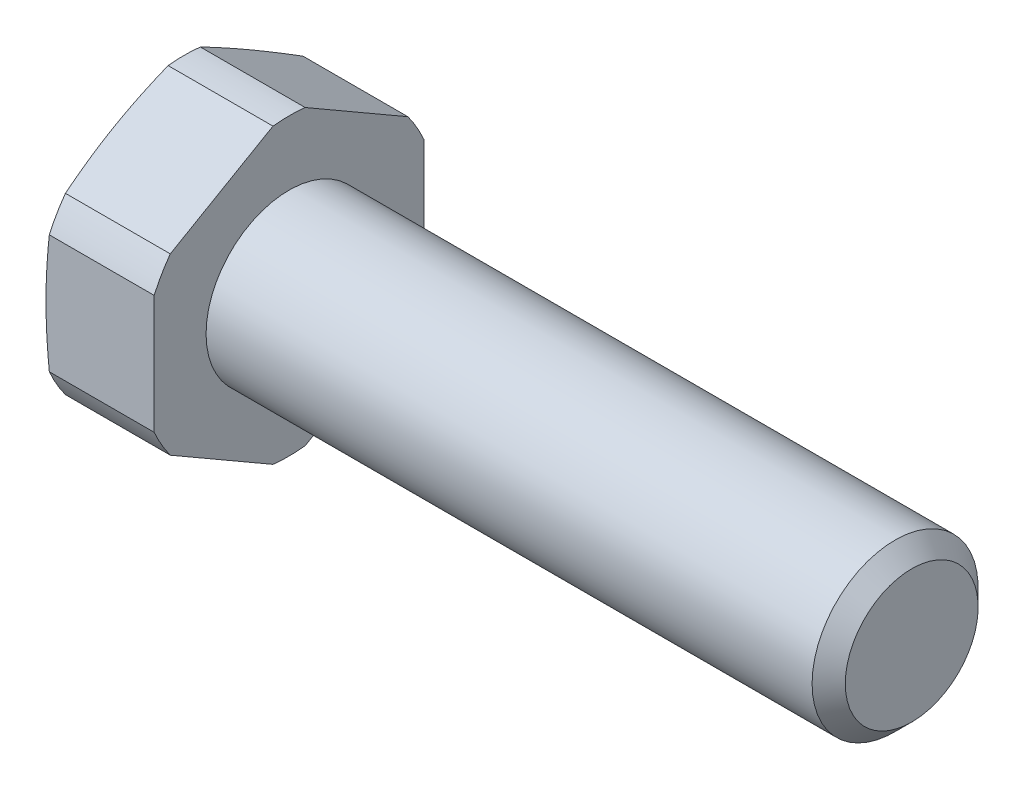
ISO-10303-21;
HEADER;
FILE_DESCRIPTION(('STEP AP214'),'2;1');
FILE_NAME('part.step','',(''),(''),'','','');
FILE_SCHEMA(('AUTOMOTIVE_DESIGN { 1 0 10303 214 1 1 1 1 }'));
ENDSEC;
DATA;
#1=APPLICATION_CONTEXT('core data for automotive mechanical design processes');
#2=APPLICATION_PROTOCOL_DEFINITION('international standard','automotive_design',2000,#1);
#3=PRODUCT_CONTEXT('',#1,'mechanical');
#4=PRODUCT('Part','Part','',(#3));
#5=PRODUCT_RELATED_PRODUCT_CATEGORY('part','',(#4));
#6=PRODUCT_DEFINITION_FORMATION('','',#4);
#7=PRODUCT_DEFINITION_CONTEXT('part definition',#1,'design');
#8=PRODUCT_DEFINITION('design','',#6,#7);
#9=PRODUCT_DEFINITION_SHAPE('','',#8);
#10=(LENGTH_UNIT() NAMED_UNIT(*) SI_UNIT(.MILLI.,.METRE.));
#11=(NAMED_UNIT(*) PLANE_ANGLE_UNIT() SI_UNIT($,.RADIAN.));
#12=(NAMED_UNIT(*) SI_UNIT($,.STERADIAN.) SOLID_ANGLE_UNIT());
#13=UNCERTAINTY_MEASURE_WITH_UNIT(LENGTH_MEASURE(1.E-05),#10,'distance_accuracy_value','');
#14=(GEOMETRIC_REPRESENTATION_CONTEXT(3) GLOBAL_UNCERTAINTY_ASSIGNED_CONTEXT((#13)) GLOBAL_UNIT_ASSIGNED_CONTEXT((#10,
#11,#12)) REPRESENTATION_CONTEXT('',''));
#15=CARTESIAN_POINT('',(0.,0.,0.));
#16=DIRECTION('',(0.,0.,1.));
#17=DIRECTION('',(1.,0.,0.));
#18=AXIS2_PLACEMENT_3D('',#15,#16,#17);
#19=CARTESIAN_POINT('',(-5.05214699700118,0.,0.));
#20=DIRECTION('',(1.,0.,0.));
#21=DIRECTION('',(0.,0.,-1.));
#22=AXIS2_PLACEMENT_3D('',#19,#20,#21);
#23=CONICAL_SURFACE('',#22,7.1,1.30899693899575);
#24=CARTESIAN_POINT('',(-5.29999999999997,0.,0.));
#25=DIRECTION('',(-1.,0.,0.));
#26=DIRECTION('',(0.,0.,1.));
#27=AXIS2_PLACEMENT_3D('',#24,#25,#26);
#28=CIRCLE('',#27,6.175);
#29=CARTESIAN_POINT('',(-5.29999999999997,0.,6.175));
#30=VERTEX_POINT('',#29);
#31=EDGE_CURVE('E139',#30,#30,#28,.T.);
#32=ORIENTED_EDGE('',*,*,#31,.F.);
#33=EDGE_LOOP('',(#32));
#34=FACE_BOUND('',#33,.T.);
#35=CARTESIAN_POINT('',(-5.05194699700118,4.19995209101869,-5.72546958900048));
#36=CARTESIAN_POINT('',(-5.07760027496928,4.31878271807594,-5.51964890544205));
#37=CARTESIAN_POINT('',(-5.10057398869207,4.43776618363352,-5.3135634978357));
#38=CARTESIAN_POINT('',(-5.14056478113438,4.67600028246682,-4.90092993456105));
#39=CARTESIAN_POINT('',(-5.1575809443837,4.79525095397189,-4.69438171267755));
#40=CARTESIAN_POINT('',(-5.18500732267828,5.0335659386847,-4.28160805094997));
#41=CARTESIAN_POINT('',(-5.19543831566365,5.15262964360177,-4.07538366469622));
#42=CARTESIAN_POINT('',(-5.20939266077495,5.39085061213871,-3.66277284376197));
#43=CARTESIAN_POINT('',(-5.21291651245986,5.51000786836884,-3.45638642188087));
#44=CARTESIAN_POINT('',(-5.21291651245985,5.74832238082912,-3.04361357811868));
#45=CARTESIAN_POINT('',(-5.20939266077494,5.86747963705925,-2.83722715623758));
#46=CARTESIAN_POINT('',(-5.19543831566363,6.10570060559619,-2.42461633530333));
#47=CARTESIAN_POINT('',(-5.18500732267826,6.22476431051326,-2.21839194904958));
#48=CARTESIAN_POINT('',(-5.15758094438367,6.46307929522607,-1.805618287322));
#49=CARTESIAN_POINT('',(-5.14056478113434,6.58232996673114,-1.5990700654385));
#50=CARTESIAN_POINT('',(-5.10057398869203,6.82056406556443,-1.18643650216385));
#51=CARTESIAN_POINT('',(-5.07760027496923,6.93954753112201,-0.980351094557502));
#52=CARTESIAN_POINT('',(-5.05194699700113,7.05837815817927,-0.774530410999076));
#53=B_SPLINE_CURVE_WITH_KNOTS('',3,(#35,#36,#37,#38,#39,#40,#41,#42,#43,#44,#45,#46,#47,#48,#49,
#50,#51,#52),.UNSPECIFIED.,.F.,.F.,(4,2,2,2,2,2,2,2,4),(0.,0.717134619479339,1.43437938951781,
2.14934960199472,2.86426810234588,3.57918660269703,4.29415681517394,5.01140158521241,
5.72853620469175),.UNSPECIFIED.);
#54=CARTESIAN_POINT('',(-5.05214699700118,4.20087943889028,-5.72386337537059));
#55=VERTEX_POINT('',#54);
#56=CARTESIAN_POINT('',(-5.05214699700118,7.05745081030742,-0.776136624629402));
#57=VERTEX_POINT('',#56);
#58=EDGE_CURVE('E211',#55,#57,#53,.T.);
#59=ORIENTED_EDGE('',*,*,#58,.F.);
#60=CARTESIAN_POINT('',(-5.05214699700118,0.,0.));
#61=DIRECTION('',(-1.,0.,0.));
#62=DIRECTION('',(0.,0.,1.));
#63=AXIS2_PLACEMENT_3D('',#60,#61,#62);
#64=CIRCLE('',#63,7.1);
#65=CARTESIAN_POINT('',(-5.05214699700118,2.85657137141714,-6.5));
#66=VERTEX_POINT('',#65);
#67=EDGE_CURVE('E294',#55,#66,#64,.T.);
#68=ORIENTED_EDGE('',*,*,#67,.T.);
#69=CARTESIAN_POINT('',(-3.77950089472168,-9.90770125370273,-6.5));
#70=CARTESIAN_POINT('',(-3.84549923221771,-9.61303683004902,-6.5));
#71=CARTESIAN_POINT('',(-3.91068708305299,-9.31818755285982,-6.5));
#72=CARTESIAN_POINT('',(-4.03900435606356,-8.72802854950381,-6.5));
#73=CARTESIAN_POINT('',(-4.10213368872072,-8.43271880389633,-6.5));
#74=CARTESIAN_POINT('',(-4.22595195035626,-7.84128094408398,-6.5));
#75=CARTESIAN_POINT('',(-4.28663840023621,-7.5451523090157,-6.5));
#76=CARTESIAN_POINT('',(-4.4049126937163,-6.95227722725182,-6.5));
#77=CARTESIAN_POINT('',(-4.46250056367929,-6.65553078583486,-6.5));
#78=CARTESIAN_POINT('',(-4.57339453337853,-6.06368986807948,-6.5));
#79=CARTESIAN_POINT('',(-4.62673117435109,-5.76860114266199,-6.5));
#80=CARTESIAN_POINT('',(-4.72872616796672,-5.17761769171761,-6.5));
#81=CARTESIAN_POINT('',(-4.77738462407619,-4.88172298416536,-6.5));
#82=CARTESIAN_POINT('',(-4.86892350982985,-4.28907239039307,-6.5));
#83=CARTESIAN_POINT('',(-4.91180468331148,-3.99231662007226,-6.5));
#84=CARTESIAN_POINT('',(-4.99052177949499,-3.39786141661488,-6.5));
#85=CARTESIAN_POINT('',(-5.02635769642816,-3.10016198270582,-6.5));
#86=CARTESIAN_POINT('',(-5.08996536212492,-2.5004683432848,-6.5));
#87=CARTESIAN_POINT('',(-5.1176408530834,-2.19846377390436,-6.5));
#88=CARTESIAN_POINT('',(-5.16301575116526,-1.59369968950732,-6.5));
#89=CARTESIAN_POINT('',(-5.18071538706159,-1.29094019196316,-6.5));
#90=CARTESIAN_POINT('',(-5.20510605570838,-0.685105061534515,-6.5));
#91=CARTESIAN_POINT('',(-5.21180202439831,-0.382029631451969,-6.5));
#92=CARTESIAN_POINT('',(-5.21377415859077,0.224158974521351,-6.5));
#93=CARTESIAN_POINT('',(-5.20905033033111,0.527272150391417,-6.5));
#94=CARTESIAN_POINT('',(-5.18844845784126,1.13421773965102,-6.5));
#95=CARTESIAN_POINT('',(-5.17252981467392,1.43804874687802,-6.5));
#96=CARTESIAN_POINT('',(-5.13044490350295,2.04499361527491,-6.5));
#97=CARTESIAN_POINT('',(-5.10427841006816,2.34810746052116,-6.5));
#98=CARTESIAN_POINT('',(-5.04301462259277,2.95361619476168,-6.5));
#99=CARTESIAN_POINT('',(-5.00791153851841,3.25601048886053,-6.5));
#100=CARTESIAN_POINT('',(-4.93022920552248,3.8598266281922,-6.5));
#101=CARTESIAN_POINT('',(-4.88764993371114,4.16124847044479,-6.5));
#102=CARTESIAN_POINT('',(-4.79942061262059,4.74304526391516,-6.5));
#103=CARTESIAN_POINT('',(-4.7541658547133,5.02348076975636,-6.5));
#104=CARTESIAN_POINT('',(-4.65928179773904,5.58361433540142,-6.5));
#105=CARTESIAN_POINT('',(-4.60965238023525,5.86331237502831,-6.5));
#106=CARTESIAN_POINT('',(-4.50681836335408,6.42207301698527,-6.5));
#107=CARTESIAN_POINT('',(-4.45361344604534,6.70113556052032,-6.5));
#108=CARTESIAN_POINT('',(-4.34428024606978,7.2586887797512,-6.5));
#109=CARTESIAN_POINT('',(-4.28815192576296,7.5371794480359,-6.5));
#110=CARTESIAN_POINT('',(-4.11617513273683,8.37203815656081,-6.5));
#111=CARTESIAN_POINT('',(-3.99675790685842,8.92767029566482,-6.5));
#112=CARTESIAN_POINT('',(-3.75146990372668,10.037459547231,-6.5));
#113=CARTESIAN_POINT('',(-3.62559950106499,10.5916167433503,-6.5));
#114=CARTESIAN_POINT('',(-3.37057620947702,11.693405700181,-6.5));
#115=CARTESIAN_POINT('',(-3.24146803677519,12.2410478396252,-6.5));
#116=CARTESIAN_POINT('',(-2.98002169310474,13.3355686749825,-6.5));
#117=CARTESIAN_POINT('',(-2.84768346371383,13.8824473568975,-6.5));
#118=CARTESIAN_POINT('',(-2.58078319258935,14.9749505577544,-6.5));
#119=CARTESIAN_POINT('',(-2.44622407444428,15.5205757923582,-6.5));
#120=CARTESIAN_POINT('',(-2.1752684767797,16.611351157403,-6.5));
#121=CARTESIAN_POINT('',(-2.03887205773507,17.1565013028558,-6.5));
#122=CARTESIAN_POINT('',(-1.90182465532039,17.7014857538417,-6.5));
#123=B_SPLINE_CURVE_WITH_KNOTS('',3,(#69,#70,#71,#72,#73,#74,#75,#76,#77,#78,#79,#80,#81,#82,
#83,#84,#85,#86,#87,#88,#89,#90,#91,#92,#93,#94,#95,#96,#97,#98,#99,#100,#101,#102,#103,#104,
#105,#106,#107,#108,#109,#110,#111,#112,#113,#114,#115,#116,#117,#118,#119,#120,#121,#122),
.UNSPECIFIED.,.F.,.F.,(4,2,2,2,2,2,2,2,2,2,2,2,2,2,2,2,2,2,2,2,2,2,2,2,2,2,4),(0.,
0.905898920692892,1.81183718353167,2.71867275809954,3.62550061605085,4.52508121778624,
5.42464191911476,6.32408668917737,7.22353219570963,8.13319785926568,9.04284266091374,
9.95207930967697,10.8613154617895,11.7738661542407,12.6864369220163,13.5996004575465,
14.5127667889475,15.3649164610577,16.2170892108291,17.0693378358233,17.9215974365787,
19.6264908547873,21.3312854197707,23.0192370587519,24.7072192505044,26.3931331153493,
28.0789916231747),.UNSPECIFIED.);
#124=CARTESIAN_POINT('',(-5.05214699700118,-2.85657137141714,-6.5));
#125=VERTEX_POINT('',#124);
#126=EDGE_CURVE('E190',#125,#66,#123,.T.);
#127=ORIENTED_EDGE('',*,*,#126,.F.);
#128=CARTESIAN_POINT('',(-5.05214699700118,-4.20087943889029,-5.72386337537059));
#129=VERTEX_POINT('',#128);
#130=EDGE_CURVE('E189',#125,#129,#64,.T.);
#131=ORIENTED_EDGE('',*,*,#130,.T.);
#132=CARTESIAN_POINT('',(-5.05194699700113,-7.05837815817927,-0.774530410999076));
#133=CARTESIAN_POINT('',(-5.07760027496923,-6.93954753112201,-0.980351094557502));
#134=CARTESIAN_POINT('',(-5.10057398869203,-6.82056406556443,-1.18643650216385));
#135=CARTESIAN_POINT('',(-5.14056478113434,-6.58232996673114,-1.5990700654385));
#136=CARTESIAN_POINT('',(-5.15758094438367,-6.46307929522607,-1.805618287322));
#137=CARTESIAN_POINT('',(-5.18500732267826,-6.22476431051326,-2.21839194904958));
#138=CARTESIAN_POINT('',(-5.19543831566363,-6.10570060559619,-2.42461633530333));
#139=CARTESIAN_POINT('',(-5.20939266077494,-5.86747963705925,-2.83722715623758));
#140=CARTESIAN_POINT('',(-5.21291651245985,-5.74832238082912,-3.04361357811868));
#141=CARTESIAN_POINT('',(-5.21291651245986,-5.51000786836884,-3.45638642188087));
#142=CARTESIAN_POINT('',(-5.20939266077495,-5.39085061213871,-3.66277284376197));
#143=CARTESIAN_POINT('',(-5.19543831566365,-5.15262964360177,-4.07538366469622));
#144=CARTESIAN_POINT('',(-5.18500732267828,-5.0335659386847,-4.28160805094997));
#145=CARTESIAN_POINT('',(-5.1575809443837,-4.79525095397189,-4.69438171267755));
#146=CARTESIAN_POINT('',(-5.14056478113438,-4.67600028246682,-4.90092993456105));
#147=CARTESIAN_POINT('',(-5.10057398869207,-4.43776618363352,-5.3135634978357));
#148=CARTESIAN_POINT('',(-5.07760027496928,-4.31878271807594,-5.51964890544205));
#149=CARTESIAN_POINT('',(-5.05194699700118,-4.19995209101869,-5.72546958900048));
#150=B_SPLINE_CURVE_WITH_KNOTS('',3,(#132,#133,#134,#135,#136,#137,#138,#139,#140,#141,#142,
#143,#144,#145,#146,#147,#148,#149),.UNSPECIFIED.,.F.,.F.,(4,2,2,2,2,2,2,2,4),(0.,
0.717134619479339,1.43437938951781,2.14934960199472,2.86426810234588,3.57918660269703,
4.29415681517395,5.01140158521242,5.72853620469176),.UNSPECIFIED.);
#151=CARTESIAN_POINT('',(-5.05214699700118,-7.05745081030742,-0.776136624629407));
#152=VERTEX_POINT('',#151);
#153=EDGE_CURVE('E276',#152,#129,#150,.T.);
#154=ORIENTED_EDGE('',*,*,#153,.F.);
#155=CARTESIAN_POINT('',(-5.05214699700118,-7.05745081030742,0.776136624629402));
#156=VERTEX_POINT('',#155);
#157=EDGE_CURVE('E296',#152,#156,#64,.T.);
#158=ORIENTED_EDGE('',*,*,#157,.T.);
#159=CARTESIAN_POINT('',(-5.05194699700118,-4.19995209101869,5.72546958900048));
#160=CARTESIAN_POINT('',(-5.07760027496928,-4.31878271807594,5.51964890544205));
#161=CARTESIAN_POINT('',(-5.10057398869207,-4.43776618363352,5.3135634978357));
#162=CARTESIAN_POINT('',(-5.14056478113438,-4.67600028246681,4.90092993456106));
#163=CARTESIAN_POINT('',(-5.1575809443837,-4.79525095397189,4.69438171267755));
#164=CARTESIAN_POINT('',(-5.18500732267828,-5.0335659386847,4.28160805094997));
#165=CARTESIAN_POINT('',(-5.19543831566365,-5.15262964360177,4.07538366469622));
#166=CARTESIAN_POINT('',(-5.20939266077495,-5.39085061213871,3.66277284376197));
#167=CARTESIAN_POINT('',(-5.21291651245986,-5.51000786836884,3.45638642188088));
#168=CARTESIAN_POINT('',(-5.21291651245985,-5.74832238082911,3.04361357811868));
#169=CARTESIAN_POINT('',(-5.20939266077494,-5.86747963705925,2.83722715623758));
#170=CARTESIAN_POINT('',(-5.19543831566363,-6.10570060559619,2.42461633530333));
#171=CARTESIAN_POINT('',(-5.18500732267826,-6.22476431051326,2.21839194904958));
#172=CARTESIAN_POINT('',(-5.15758094438367,-6.46307929522606,1.805618287322));
#173=CARTESIAN_POINT('',(-5.14056478113434,-6.58232996673114,1.5990700654385));
#174=CARTESIAN_POINT('',(-5.10057398869203,-6.82056406556443,1.18643650216385));
#175=CARTESIAN_POINT('',(-5.07760027496923,-6.93954753112201,0.980351094557502));
#176=CARTESIAN_POINT('',(-5.05194699700113,-7.05837815817926,0.774530410999075));
#177=B_SPLINE_CURVE_WITH_KNOTS('',3,(#159,#160,#161,#162,#163,#164,#165,#166,#167,#168,#169,
#170,#171,#172,#173,#174,#175,#176),.UNSPECIFIED.,.F.,.F.,(4,2,2,2,2,2,2,2,4),(0.,
0.717134619479339,1.43437938951781,2.14934960199472,2.86426810234588,3.57918660269703,
4.29415681517395,5.01140158521242,5.72853620469176),.UNSPECIFIED.);
#178=CARTESIAN_POINT('',(-5.05214699700118,-4.20087943889028,5.72386337537059));
#179=VERTEX_POINT('',#178);
#180=EDGE_CURVE('E265',#179,#156,#177,.T.);
#181=ORIENTED_EDGE('',*,*,#180,.F.);
#182=CARTESIAN_POINT('',(-5.05214699700118,-2.85657137141715,6.5));
#183=VERTEX_POINT('',#182);
#184=EDGE_CURVE('E157',#179,#183,#64,.T.);
#185=ORIENTED_EDGE('',*,*,#184,.T.);
#186=CARTESIAN_POINT('',(-3.77950089472168,-9.90770125370273,6.5));
#187=CARTESIAN_POINT('',(-3.84549923221771,-9.61303683004902,6.5));
#188=CARTESIAN_POINT('',(-3.910687083053,-9.31818755285982,6.5));
#189=CARTESIAN_POINT('',(-4.03900435606356,-8.72802854950381,6.5));
#190=CARTESIAN_POINT('',(-4.10213368872072,-8.43271880389633,6.5));
#191=CARTESIAN_POINT('',(-4.22595195035626,-7.84128094408397,6.5));
#192=CARTESIAN_POINT('',(-4.28663840023621,-7.5451523090157,6.5));
#193=CARTESIAN_POINT('',(-4.4049126937163,-6.95227722725182,6.5));
#194=CARTESIAN_POINT('',(-4.46250056367929,-6.65553078583486,6.5));
#195=CARTESIAN_POINT('',(-4.57339453337853,-6.06368986807948,6.5));
#196=CARTESIAN_POINT('',(-4.62673117435109,-5.76860114266198,6.5));
#197=CARTESIAN_POINT('',(-4.72872616796673,-5.1776176917176,6.5));
#198=CARTESIAN_POINT('',(-4.7773846240762,-4.88172298416536,6.5));
#199=CARTESIAN_POINT('',(-4.86892350982985,-4.28907239039307,6.5));
#200=CARTESIAN_POINT('',(-4.91180468331148,-3.99231662007226,6.5));
#201=CARTESIAN_POINT('',(-4.99052177949499,-3.39786141661488,6.5));
#202=CARTESIAN_POINT('',(-5.02635769642816,-3.10016198270582,6.5));
#203=CARTESIAN_POINT('',(-5.08996536212492,-2.5004683432848,6.5));
#204=CARTESIAN_POINT('',(-5.1176408530834,-2.19846377390436,6.5));
#205=CARTESIAN_POINT('',(-5.16301575116526,-1.59369968950732,6.5));
#206=CARTESIAN_POINT('',(-5.18071538706159,-1.29094019196316,6.5));
#207=CARTESIAN_POINT('',(-5.20510605570838,-0.685105061534518,6.5));
#208=CARTESIAN_POINT('',(-5.21180202439831,-0.382029631451971,6.5));
#209=CARTESIAN_POINT('',(-5.21377415859077,0.224158974521348,6.5));
#210=CARTESIAN_POINT('',(-5.20905033033111,0.527272150391414,6.5));
#211=CARTESIAN_POINT('',(-5.18844845784126,1.13421773965101,6.5));
#212=CARTESIAN_POINT('',(-5.17252981467392,1.43804874687802,6.5));
#213=CARTESIAN_POINT('',(-5.13044490350295,2.04499361527491,6.5));
#214=CARTESIAN_POINT('',(-5.10427841006816,2.34810746052116,6.5));
#215=CARTESIAN_POINT('',(-5.04301462259277,2.95361619476167,6.5));
#216=CARTESIAN_POINT('',(-5.00791153851841,3.25601048886052,6.5));
#217=CARTESIAN_POINT('',(-4.93022920552248,3.85982662819219,6.5));
#218=CARTESIAN_POINT('',(-4.88764993371114,4.16124847044479,6.5));
#219=CARTESIAN_POINT('',(-4.79942061262059,4.74304526391516,6.5));
#220=CARTESIAN_POINT('',(-4.7541658547133,5.02348076975635,6.5));
#221=CARTESIAN_POINT('',(-4.65928179773904,5.58361433540142,6.5));
#222=CARTESIAN_POINT('',(-4.60965238023525,5.86331237502831,6.5));
#223=CARTESIAN_POINT('',(-4.50681836335408,6.42207301698527,6.5));
#224=CARTESIAN_POINT('',(-4.45361344604534,6.70113556052032,6.5));
#225=CARTESIAN_POINT('',(-4.34428024606978,7.2586887797512,6.5));
#226=CARTESIAN_POINT('',(-4.28815192576296,7.53717944803591,6.5));
#227=CARTESIAN_POINT('',(-4.11617513273683,8.37203815656081,6.5));
#228=CARTESIAN_POINT('',(-3.99675790685842,8.92767029566482,6.5));
#229=CARTESIAN_POINT('',(-3.75146990372668,10.037459547231,6.5));
#230=CARTESIAN_POINT('',(-3.62559950106499,10.5916167433503,6.5));
#231=CARTESIAN_POINT('',(-3.37057620947702,11.693405700181,6.5));
#232=CARTESIAN_POINT('',(-3.24146803677519,12.2410478396252,6.5));
#233=CARTESIAN_POINT('',(-2.98002169310474,13.3355686749825,6.5));
#234=CARTESIAN_POINT('',(-2.84768346371383,13.8824473568975,6.5));
#235=CARTESIAN_POINT('',(-2.58078319258935,14.9749505577544,6.5));
#236=CARTESIAN_POINT('',(-2.44622407444428,15.5205757923582,6.5));
#237=CARTESIAN_POINT('',(-2.1752684767797,16.611351157403,6.5));
#238=CARTESIAN_POINT('',(-2.03887205773507,17.1565013028558,6.5));
#239=CARTESIAN_POINT('',(-1.90182465532039,17.7014857538417,6.5));
#240=B_SPLINE_CURVE_WITH_KNOTS('',3,(#186,#187,#188,#189,#190,#191,#192,#193,#194,#195,#196,
#197,#198,#199,#200,#201,#202,#203,#204,#205,#206,#207,#208,#209,#210,#211,#212,#213,#214,#215,
#216,#217,#218,#219,#220,#221,#222,#223,#224,#225,#226,#227,#228,#229,#230,#231,#232,#233,#234,
#235,#236,#237,#238,#239),.UNSPECIFIED.,.F.,.F.,(4,2,2,2,2,2,2,2,2,2,2,2,2,2,2,2,2,2,2,2,2,2,2,
2,2,2,4),(0.,0.905898920692892,1.81183718353167,2.71867275809954,3.62550061605085,
4.52508121778624,5.42464191911476,6.32408668917737,7.22353219570962,8.13319785926568,
9.04284266091373,9.95207930967697,10.8613154617895,11.7738661542407,12.6864369220163,
13.5996004575465,14.5127667889475,15.3649164610577,16.217089210829,17.0693378358233,
17.9215974365787,19.6264908547873,21.3312854197707,23.0192370587519,24.7072192505044,
26.3931331153493,28.0789916231747),.UNSPECIFIED.);
#241=CARTESIAN_POINT('',(-5.05214699700118,2.85657137141715,6.5));
#242=VERTEX_POINT('',#241);
#243=EDGE_CURVE('E248',#242,#183,#240,.F.);
#244=ORIENTED_EDGE('',*,*,#243,.F.);
#245=CARTESIAN_POINT('',(-5.05214699700118,4.20087943889028,5.72386337537059));
#246=VERTEX_POINT('',#245);
#247=EDGE_CURVE('E165',#242,#246,#64,.T.);
#248=ORIENTED_EDGE('',*,*,#247,.T.);
#249=CARTESIAN_POINT('',(-5.05194699700113,7.05837815817927,0.774530410999076));
#250=CARTESIAN_POINT('',(-5.07760027496923,6.93954753112201,0.980351094557502));
#251=CARTESIAN_POINT('',(-5.10057398869203,6.82056406556443,1.18643650216385));
#252=CARTESIAN_POINT('',(-5.14056478113434,6.58232996673114,1.5990700654385));
#253=CARTESIAN_POINT('',(-5.15758094438367,6.46307929522607,1.805618287322));
#254=CARTESIAN_POINT('',(-5.18500732267826,6.22476431051326,2.21839194904958));
#255=CARTESIAN_POINT('',(-5.19543831566363,6.10570060559619,2.42461633530333));
#256=CARTESIAN_POINT('',(-5.20939266077494,5.86747963705925,2.83722715623758));
#257=CARTESIAN_POINT('',(-5.21291651245985,5.74832238082911,3.04361357811868));
#258=CARTESIAN_POINT('',(-5.21291651245986,5.51000786836884,3.45638642188087));
#259=CARTESIAN_POINT('',(-5.20939266077495,5.39085061213871,3.66277284376197));
#260=CARTESIAN_POINT('',(-5.19543831566365,5.15262964360177,4.07538366469622));
#261=CARTESIAN_POINT('',(-5.18500732267828,5.0335659386847,4.28160805094997));
#262=CARTESIAN_POINT('',(-5.1575809443837,4.79525095397189,4.69438171267755));
#263=CARTESIAN_POINT('',(-5.14056478113438,4.67600028246682,4.90092993456105));
#264=CARTESIAN_POINT('',(-5.10057398869207,4.43776618363352,5.3135634978357));
#265=CARTESIAN_POINT('',(-5.07760027496928,4.31878271807594,5.51964890544205));
#266=CARTESIAN_POINT('',(-5.05194699700118,4.19995209101869,5.72546958900048));
#267=B_SPLINE_CURVE_WITH_KNOTS('',3,(#249,#250,#251,#252,#253,#254,#255,#256,#257,#258,#259,
#260,#261,#262,#263,#264,#265,#266),.UNSPECIFIED.,.F.,.F.,(4,2,2,2,2,2,2,2,4),(0.,
0.71713461947934,1.43437938951781,2.14934960199472,2.86426810234588,3.57918660269703,
4.29415681517394,5.01140158521241,5.72853620469175),.UNSPECIFIED.);
#268=CARTESIAN_POINT('',(-5.05214699700118,7.05745081030742,0.776136624629402));
#269=VERTEX_POINT('',#268);
#270=EDGE_CURVE('E149',#269,#246,#267,.T.);
#271=ORIENTED_EDGE('',*,*,#270,.F.);
#272=EDGE_CURVE('E148',#269,#57,#64,.T.);
#273=ORIENTED_EDGE('',*,*,#272,.T.);
#274=EDGE_LOOP('',(#59,#68,#127,#131,#154,#158,#181,#185,#244,#248,#271,#273));
#275=FACE_BOUND('',#274,.T.);
#276=ADVANCED_FACE('F40',(#34,#275),#23,.T.);
#277=CARTESIAN_POINT('',(-1000.,0.,0.));
#278=DIRECTION('',(-1.,0.,0.));
#279=DIRECTION('',(0.,0.,1.));
#280=AXIS2_PLACEMENT_3D('',#277,#278,#279);
#281=CYLINDRICAL_SURFACE('',#280,7.1);
#282=DIRECTION('',(-1.,0.,0.));
#283=VECTOR('',#282,1.);
#284=CARTESIAN_POINT('',(-1000.,4.20087943889028,-5.72386337537059));
#285=LINE('',#284,#283);
#286=CARTESIAN_POINT('',(0.,4.20087943889029,-5.72386337537059));
#287=VERTEX_POINT('',#286);
#288=EDGE_CURVE('E220',#287,#55,#285,.T.);
#289=ORIENTED_EDGE('',*,*,#288,.F.);
#290=CARTESIAN_POINT('',(0.,0.,0.));
#291=DIRECTION('',(-1.,0.,0.));
#292=DIRECTION('',(0.,0.,1.));
#293=AXIS2_PLACEMENT_3D('',#290,#291,#292);
#294=CIRCLE('',#293,7.1);
#295=CARTESIAN_POINT('',(0.,2.85657137141714,-6.5));
#296=VERTEX_POINT('',#295);
#297=EDGE_CURVE('E155',#287,#296,#294,.T.);
#298=ORIENTED_EDGE('',*,*,#297,.T.);
#299=DIRECTION('',(-1.,0.,0.));
#300=VECTOR('',#299,1.);
#301=CARTESIAN_POINT('',(-1000.,2.85657137141714,-6.5));
#302=LINE('',#301,#300);
#303=EDGE_CURVE('E181',#66,#296,#302,.F.);
#304=ORIENTED_EDGE('',*,*,#303,.F.);
#305=ORIENTED_EDGE('',*,*,#67,.F.);
#306=EDGE_LOOP('',(#289,#298,#304,#305));
#307=FACE_BOUND('',#306,.T.);
#308=ADVANCED_FACE('F295',(#307),#281,.T.);
#309=DIRECTION('',(-1.,0.,0.));
#310=VECTOR('',#309,1.);
#311=CARTESIAN_POINT('',(-1000.,7.05745081030742,-0.776136624629402));
#312=LINE('',#311,#310);
#313=CARTESIAN_POINT('',(0.,7.05745081030742,-0.776136624629404));
#314=VERTEX_POINT('',#313);
#315=EDGE_CURVE('E287',#57,#314,#312,.F.);
#316=ORIENTED_EDGE('',*,*,#315,.F.);
#317=ORIENTED_EDGE('',*,*,#272,.F.);
#318=DIRECTION('',(-1.,0.,0.));
#319=VECTOR('',#318,1.);
#320=CARTESIAN_POINT('',(-1000.,7.05745081030742,0.776136624629402));
#321=LINE('',#320,#319);
#322=CARTESIAN_POINT('',(0.,7.05745081030742,0.776136624629403));
#323=VERTEX_POINT('',#322);
#324=EDGE_CURVE('E130',#323,#269,#321,.T.);
#325=ORIENTED_EDGE('',*,*,#324,.F.);
#326=EDGE_CURVE('E146',#323,#314,#294,.T.);
#327=ORIENTED_EDGE('',*,*,#326,.T.);
#328=EDGE_LOOP('',(#316,#317,#325,#327));
#329=FACE_BOUND('',#328,.T.);
#330=ADVANCED_FACE('F145',(#329),#281,.T.);
#331=DIRECTION('',(-1.,0.,0.));
#332=VECTOR('',#331,1.);
#333=CARTESIAN_POINT('',(-1000.,-2.85657137141714,-6.5));
#334=LINE('',#333,#332);
#335=CARTESIAN_POINT('',(0.,-2.85657137141714,-6.5));
#336=VERTEX_POINT('',#335);
#337=EDGE_CURVE('E178',#336,#125,#334,.T.);
#338=ORIENTED_EDGE('',*,*,#337,.F.);
#339=CARTESIAN_POINT('',(0.,-4.20087943889028,-5.72386337537059));
#340=VERTEX_POINT('',#339);
#341=EDGE_CURVE('E160',#336,#340,#294,.T.);
#342=ORIENTED_EDGE('',*,*,#341,.T.);
#343=DIRECTION('',(-1.,0.,0.));
#344=VECTOR('',#343,1.);
#345=CARTESIAN_POINT('',(-1000.,-4.20087943889029,-5.72386337537059));
#346=LINE('',#345,#344);
#347=EDGE_CURVE('E271',#129,#340,#346,.F.);
#348=ORIENTED_EDGE('',*,*,#347,.F.);
#349=ORIENTED_EDGE('',*,*,#130,.F.);
#350=EDGE_LOOP('',(#338,#342,#348,#349));
#351=FACE_BOUND('',#350,.T.);
#352=ADVANCED_FACE('F186',(#351),#281,.T.);
#353=DIRECTION('',(-1.,0.,0.));
#354=VECTOR('',#353,1.);
#355=CARTESIAN_POINT('',(-1000.,-7.05745081030742,-0.776136624629407));
#356=LINE('',#355,#354);
#357=CARTESIAN_POINT('',(0.,-7.05745081030742,-0.776136624629403));
#358=VERTEX_POINT('',#357);
#359=EDGE_CURVE('E274',#358,#152,#356,.T.);
#360=ORIENTED_EDGE('',*,*,#359,.F.);
#361=CARTESIAN_POINT('',(0.,-7.05745081030742,0.776136624629396));
#362=VERTEX_POINT('',#361);
#363=EDGE_CURVE('E194',#358,#362,#294,.T.);
#364=ORIENTED_EDGE('',*,*,#363,.T.);
#365=DIRECTION('',(-1.,0.,0.));
#366=VECTOR('',#365,1.);
#367=CARTESIAN_POINT('',(-1000.,-7.05745081030742,0.776136624629402));
#368=LINE('',#367,#366);
#369=EDGE_CURVE('E63',#156,#362,#368,.F.);
#370=ORIENTED_EDGE('',*,*,#369,.F.);
#371=ORIENTED_EDGE('',*,*,#157,.F.);
#372=EDGE_LOOP('',(#360,#364,#370,#371));
#373=FACE_BOUND('',#372,.T.);
#374=ADVANCED_FACE('F315',(#373),#281,.T.);
#375=DIRECTION('',(-1.,0.,0.));
#376=VECTOR('',#375,1.);
#377=CARTESIAN_POINT('',(-1000.,-4.20087943889028,5.72386337537059));
#378=LINE('',#377,#376);
#379=CARTESIAN_POINT('',(0.,-4.20087943889028,5.7238633753706));
#380=VERTEX_POINT('',#379);
#381=EDGE_CURVE('E272',#380,#179,#378,.T.);
#382=ORIENTED_EDGE('',*,*,#381,.F.);
#383=CARTESIAN_POINT('',(0.,-2.85657137141715,6.5));
#384=VERTEX_POINT('',#383);
#385=EDGE_CURVE('E158',#380,#384,#294,.T.);
#386=ORIENTED_EDGE('',*,*,#385,.T.);
#387=DIRECTION('',(-1.,0.,0.));
#388=VECTOR('',#387,1.);
#389=CARTESIAN_POINT('',(-1000.,-2.85657137141715,6.5));
#390=LINE('',#389,#388);
#391=EDGE_CURVE('E55',#183,#384,#390,.F.);
#392=ORIENTED_EDGE('',*,*,#391,.F.);
#393=ORIENTED_EDGE('',*,*,#184,.F.);
#394=EDGE_LOOP('',(#382,#386,#392,#393));
#395=FACE_BOUND('',#394,.T.);
#396=ADVANCED_FACE('F305',(#395),#281,.T.);
#397=DIRECTION('',(-1.,0.,0.));
#398=VECTOR('',#397,1.);
#399=CARTESIAN_POINT('',(-1000.,2.85657137141715,6.5));
#400=LINE('',#399,#398);
#401=CARTESIAN_POINT('',(0.,2.85657137141715,6.5));
#402=VERTEX_POINT('',#401);
#403=EDGE_CURVE('E246',#402,#242,#400,.T.);
#404=ORIENTED_EDGE('',*,*,#403,.F.);
#405=CARTESIAN_POINT('',(0.,4.20087943889028,5.72386337537059));
#406=VERTEX_POINT('',#405);
#407=EDGE_CURVE('E154',#402,#406,#294,.T.);
#408=ORIENTED_EDGE('',*,*,#407,.T.);
#409=DIRECTION('',(-1.,0.,0.));
#410=VECTOR('',#409,1.);
#411=CARTESIAN_POINT('',(-1000.,4.20087943889028,5.72386337537059));
#412=LINE('',#411,#410);
#413=EDGE_CURVE('E133',#246,#406,#412,.F.);
#414=ORIENTED_EDGE('',*,*,#413,.F.);
#415=ORIENTED_EDGE('',*,*,#247,.F.);
#416=EDGE_LOOP('',(#404,#408,#414,#415));
#417=FACE_BOUND('',#416,.T.);
#418=ADVANCED_FACE('F308',(#417),#281,.T.);
#419=CARTESIAN_POINT('',(0.,7.1,0.));
#420=DIRECTION('',(-1.,0.,0.));
#421=DIRECTION('',(0.,0.,1.));
#422=AXIS2_PLACEMENT_3D('',#419,#420,#421);
#423=PLANE('',#422);
#424=CARTESIAN_POINT('',(0.,0.,0.));
#425=DIRECTION('',(-1.,0.,0.));
#426=DIRECTION('',(0.,0.,1.));
#427=AXIS2_PLACEMENT_3D('',#424,#425,#426);
#428=CIRCLE('',#427,4.);
#429=CARTESIAN_POINT('',(0.,0.,4.));
#430=VERTEX_POINT('',#429);
#431=EDGE_CURVE('E163',#430,#430,#428,.T.);
#432=ORIENTED_EDGE('',*,*,#431,.T.);
#433=EDGE_LOOP('',(#432));
#434=FACE_BOUND('',#433,.T.);
#435=DIRECTION('',(0.,-0.5,-0.866025403784439));
#436=VECTOR('',#435,1.);
#437=CARTESIAN_POINT('',(0.,7.40416512459885,-0.175609816565242));
#438=LINE('',#437,#436);
#439=EDGE_CURVE('E12',#314,#287,#438,.T.);
#440=ORIENTED_EDGE('',*,*,#439,.F.);
#441=ORIENTED_EDGE('',*,*,#326,.F.);
#442=DIRECTION('',(0.,0.5,-0.866025403784439));
#443=VECTOR('',#442,1.);
#444=CARTESIAN_POINT('',(0.,7.40416512459885,0.175609816565242));
#445=LINE('',#444,#443);
#446=EDGE_CURVE('E127',#406,#323,#445,.T.);
#447=ORIENTED_EDGE('',*,*,#446,.F.);
#448=ORIENTED_EDGE('',*,*,#407,.F.);
#449=DIRECTION('',(0.,1.,0.));
#450=VECTOR('',#449,1.);
#451=CARTESIAN_POINT('',(0.,7.1,6.5));
#452=LINE('',#451,#450);
#453=EDGE_CURVE('E138',#384,#402,#452,.T.);
#454=ORIENTED_EDGE('',*,*,#453,.F.);
#455=ORIENTED_EDGE('',*,*,#385,.F.);
#456=DIRECTION('',(0.,0.5,0.866025403784439));
#457=VECTOR('',#456,1.);
#458=CARTESIAN_POINT('',(0.,-3.85416512459885,6.32439018343475));
#459=LINE('',#458,#457);
#460=EDGE_CURVE('E171',#362,#380,#459,.T.);
#461=ORIENTED_EDGE('',*,*,#460,.F.);
#462=ORIENTED_EDGE('',*,*,#363,.F.);
#463=DIRECTION('',(0.,-0.5,0.866025403784439));
#464=VECTOR('',#463,1.);
#465=CARTESIAN_POINT('',(0.,-3.85416512459885,-6.32439018343476));
#466=LINE('',#465,#464);
#467=EDGE_CURVE('E173',#340,#358,#466,.T.);
#468=ORIENTED_EDGE('',*,*,#467,.F.);
#469=ORIENTED_EDGE('',*,*,#341,.F.);
#470=DIRECTION('',(0.,-1.,0.));
#471=VECTOR('',#470,1.);
#472=CARTESIAN_POINT('',(0.,7.1,-6.5));
#473=LINE('',#472,#471);
#474=EDGE_CURVE('E48',#296,#336,#473,.T.);
#475=ORIENTED_EDGE('',*,*,#474,.F.);
#476=ORIENTED_EDGE('',*,*,#297,.F.);
#477=EDGE_LOOP('',(#440,#441,#447,#448,#454,#455,#461,#462,#468,#469,#475,#476));
#478=FACE_BOUND('',#477,.T.);
#479=ADVANCED_FACE('F152',(#434,#478),#423,.F.);
#480=CARTESIAN_POINT('',(-5.29999999999999,0.,0.));
#481=DIRECTION('',(1.,0.,0.));
#482=DIRECTION('',(0.,0.,-1.));
#483=AXIS2_PLACEMENT_3D('',#480,#481,#482);
#484=PLANE('',#483);
#485=ORIENTED_EDGE('',*,*,#31,.T.);
#486=EDGE_LOOP('',(#485));
#487=FACE_BOUND('',#486,.T.);
#488=ADVANCED_FACE('F42',(#487),#484,.F.);
#489=CARTESIAN_POINT('',(-1000.,0.,0.));
#490=DIRECTION('',(-1.,0.,0.));
#491=DIRECTION('',(0.,0.,1.));
#492=AXIS2_PLACEMENT_3D('',#489,#490,#491);
#493=CYLINDRICAL_SURFACE('',#492,4.);
#494=ORIENTED_EDGE('',*,*,#431,.F.);
#495=EDGE_LOOP('',(#494));
#496=FACE_BOUND('',#495,.T.);
#497=CARTESIAN_POINT('',(29.1999999999999,0.,0.));
#498=DIRECTION('',(-1.,0.,0.));
#499=DIRECTION('',(0.,0.,1.));
#500=AXIS2_PLACEMENT_3D('',#497,#498,#499);
#501=CIRCLE('',#500,4.);
#502=CARTESIAN_POINT('',(29.1999999999999,0.,4.));
#503=VERTEX_POINT('',#502);
#504=EDGE_CURVE('E203',#503,#503,#501,.T.);
#505=ORIENTED_EDGE('',*,*,#504,.T.);
#506=EDGE_LOOP('',(#505));
#507=FACE_BOUND('',#506,.T.);
#508=ADVANCED_FACE('F324',(#496,#507),#493,.T.);
#509=CARTESIAN_POINT('',(30.,0.,0.));
#510=DIRECTION('',(-1.,0.,0.));
#511=DIRECTION('',(0.,0.,1.));
#512=AXIS2_PLACEMENT_3D('',#509,#510,#511);
#513=CONICAL_SURFACE('',#512,3.20000000000001,0.785398163397362);
#514=ORIENTED_EDGE('',*,*,#504,.F.);
#515=EDGE_LOOP('',(#514));
#516=FACE_BOUND('',#515,.T.);
#517=CARTESIAN_POINT('',(30.,0.,0.));
#518=DIRECTION('',(-1.,0.,0.));
#519=DIRECTION('',(0.,0.,1.));
#520=AXIS2_PLACEMENT_3D('',#517,#518,#519);
#521=CIRCLE('',#520,3.20000000000001);
#522=CARTESIAN_POINT('',(30.,0.,3.20000000000001));
#523=VERTEX_POINT('',#522);
#524=EDGE_CURVE('E207',#523,#523,#521,.T.);
#525=ORIENTED_EDGE('',*,*,#524,.T.);
#526=EDGE_LOOP('',(#525));
#527=FACE_BOUND('',#526,.T.);
#528=ADVANCED_FACE('F328',(#516,#527),#513,.T.);
#529=CARTESIAN_POINT('',(30.,3.20000000000001,0.));
#530=DIRECTION('',(-1.,0.,0.));
#531=DIRECTION('',(0.,0.,1.));
#532=AXIS2_PLACEMENT_3D('',#529,#530,#531);
#533=PLANE('',#532);
#534=ORIENTED_EDGE('',*,*,#524,.F.);
#535=EDGE_LOOP('',(#534));
#536=FACE_BOUND('',#535,.T.);
#537=ADVANCED_FACE('F236',(#536),#533,.F.);
#538=CARTESIAN_POINT('',(50.8699663951175,3.75277674973257,6.5));
#539=DIRECTION('',(0.,0.866025403784439,0.5));
#540=DIRECTION('',(0.,-0.5,0.866025403784439));
#541=AXIS2_PLACEMENT_3D('',#538,#539,#540);
#542=PLANE('',#541);
#543=ORIENTED_EDGE('',*,*,#270,.T.);
#544=ORIENTED_EDGE('',*,*,#413,.T.);
#545=ORIENTED_EDGE('',*,*,#446,.T.);
#546=ORIENTED_EDGE('',*,*,#324,.T.);
#547=EDGE_LOOP('',(#543,#544,#545,#546));
#548=FACE_BOUND('',#547,.T.);
#549=ADVANCED_FACE('F129',(#548),#542,.T.);
#550=CARTESIAN_POINT('',(50.8699663951175,-3.75277674973257,6.5));
#551=DIRECTION('',(0.,0.,1.));
#552=DIRECTION('',(1.,0.,0.));
#553=AXIS2_PLACEMENT_3D('',#550,#551,#552);
#554=PLANE('',#553);
#555=ORIENTED_EDGE('',*,*,#243,.T.);
#556=ORIENTED_EDGE('',*,*,#391,.T.);
#557=ORIENTED_EDGE('',*,*,#453,.T.);
#558=ORIENTED_EDGE('',*,*,#403,.T.);
#559=EDGE_LOOP('',(#555,#556,#557,#558));
#560=FACE_BOUND('',#559,.T.);
#561=ADVANCED_FACE('F235',(#560),#554,.T.);
#562=CARTESIAN_POINT('',(50.8699663951175,-7.50555349946513,0.));
#563=DIRECTION('',(0.,-0.866025403784439,0.5));
#564=DIRECTION('',(0.,-0.5,-0.866025403784439));
#565=AXIS2_PLACEMENT_3D('',#562,#563,#564);
#566=PLANE('',#565);
#567=ORIENTED_EDGE('',*,*,#180,.T.);
#568=ORIENTED_EDGE('',*,*,#369,.T.);
#569=ORIENTED_EDGE('',*,*,#460,.T.);
#570=ORIENTED_EDGE('',*,*,#381,.T.);
#571=EDGE_LOOP('',(#567,#568,#569,#570));
#572=FACE_BOUND('',#571,.T.);
#573=ADVANCED_FACE('F259',(#572),#566,.T.);
#574=CARTESIAN_POINT('',(50.8699663951175,-3.75277674973257,-6.5));
#575=DIRECTION('',(0.,-0.866025403784439,-0.5));
#576=DIRECTION('',(0.,0.5,-0.866025403784439));
#577=AXIS2_PLACEMENT_3D('',#574,#575,#576);
#578=PLANE('',#577);
#579=ORIENTED_EDGE('',*,*,#153,.T.);
#580=ORIENTED_EDGE('',*,*,#347,.T.);
#581=ORIENTED_EDGE('',*,*,#467,.T.);
#582=ORIENTED_EDGE('',*,*,#359,.T.);
#583=EDGE_LOOP('',(#579,#580,#581,#582));
#584=FACE_BOUND('',#583,.T.);
#585=ADVANCED_FACE('F262',(#584),#578,.T.);
#586=CARTESIAN_POINT('',(50.8699663951175,3.75277674973257,-6.5));
#587=DIRECTION('',(0.,0.,-1.));
#588=DIRECTION('',(-1.,0.,0.));
#589=AXIS2_PLACEMENT_3D('',#586,#587,#588);
#590=PLANE('',#589);
#591=ORIENTED_EDGE('',*,*,#126,.T.);
#592=ORIENTED_EDGE('',*,*,#303,.T.);
#593=ORIENTED_EDGE('',*,*,#474,.T.);
#594=ORIENTED_EDGE('',*,*,#337,.T.);
#595=EDGE_LOOP('',(#591,#592,#593,#594));
#596=FACE_BOUND('',#595,.T.);
#597=ADVANCED_FACE('F177',(#596),#590,.T.);
#598=CARTESIAN_POINT('',(50.8699663951175,7.50555349946513,0.));
#599=DIRECTION('',(0.,0.866025403784439,-0.5));
#600=DIRECTION('',(0.,0.5,0.866025403784439));
#601=AXIS2_PLACEMENT_3D('',#598,#599,#600);
#602=PLANE('',#601);
#603=ORIENTED_EDGE('',*,*,#58,.T.);
#604=ORIENTED_EDGE('',*,*,#315,.T.);
#605=ORIENTED_EDGE('',*,*,#439,.T.);
#606=ORIENTED_EDGE('',*,*,#288,.T.);
#607=EDGE_LOOP('',(#603,#604,#605,#606));
#608=FACE_BOUND('',#607,.T.);
#609=ADVANCED_FACE('F224',(#608),#602,.T.);
#610=CLOSED_SHELL('',(#276,#308,#330,#352,#374,#396,#418,#479,#488,#508,#528,#537,#549,#561,
#573,#585,#597,#609));
#611=MANIFOLD_SOLID_BREP('B2',#610);
#612=ADVANCED_BREP_SHAPE_REPRESENTATION('',(#18,#611),#14);
#613=SHAPE_DEFINITION_REPRESENTATION(#9,#612);
ENDSEC;
END-ISO-10303-21;
